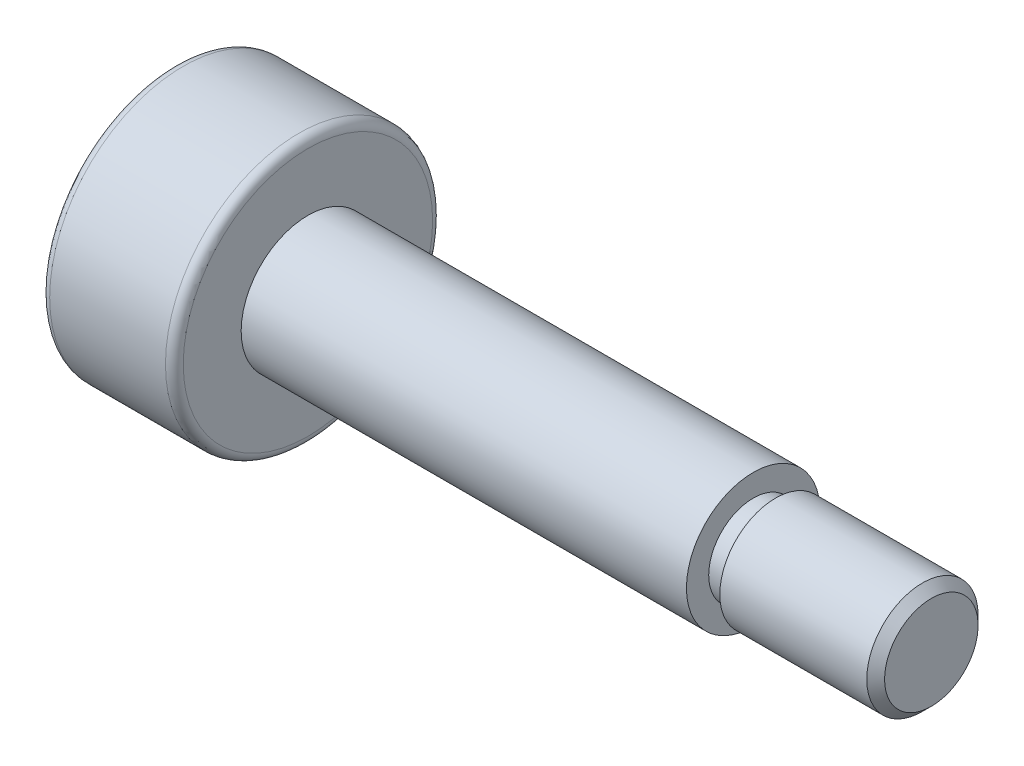
ISO-10303-21;
HEADER;
FILE_DESCRIPTION(('STEP AP214'),'2;1');
FILE_NAME('part.step','',(''),(''),'','','');
FILE_SCHEMA(('AUTOMOTIVE_DESIGN { 1 0 10303 214 1 1 1 1 }'));
ENDSEC;
DATA;
#1=APPLICATION_CONTEXT('core data for automotive mechanical design processes');
#2=APPLICATION_PROTOCOL_DEFINITION('international standard','automotive_design',2000,#1);
#3=PRODUCT_CONTEXT('',#1,'mechanical');
#4=PRODUCT('Part','Part','',(#3));
#5=PRODUCT_RELATED_PRODUCT_CATEGORY('part','',(#4));
#6=PRODUCT_DEFINITION_FORMATION('','',#4);
#7=PRODUCT_DEFINITION_CONTEXT('part definition',#1,'design');
#8=PRODUCT_DEFINITION('design','',#6,#7);
#9=PRODUCT_DEFINITION_SHAPE('','',#8);
#10=(LENGTH_UNIT() NAMED_UNIT(*) SI_UNIT(.MILLI.,.METRE.));
#11=(NAMED_UNIT(*) PLANE_ANGLE_UNIT() SI_UNIT($,.RADIAN.));
#12=(NAMED_UNIT(*) SI_UNIT($,.STERADIAN.) SOLID_ANGLE_UNIT());
#13=UNCERTAINTY_MEASURE_WITH_UNIT(LENGTH_MEASURE(1.E-05),#10,'distance_accuracy_value','');
#14=(GEOMETRIC_REPRESENTATION_CONTEXT(3) GLOBAL_UNCERTAINTY_ASSIGNED_CONTEXT((#13)) GLOBAL_UNIT_ASSIGNED_CONTEXT((#10,
#11,#12)) REPRESENTATION_CONTEXT('',''));
#15=CARTESIAN_POINT('',(0.,0.,0.));
#16=DIRECTION('',(0.,0.,1.));
#17=DIRECTION('',(1.,0.,0.));
#18=AXIS2_PLACEMENT_3D('',#15,#16,#17);
#19=CARTESIAN_POINT('',(-8.5,0.,0.));
#20=DIRECTION('',(1.,0.,0.));
#21=DIRECTION('',(0.,0.,-1.));
#22=AXIS2_PLACEMENT_3D('',#19,#20,#21);
#23=PLANE('',#22);
#24=DIRECTION('',(0.,0.866025403784438,-0.5));
#25=VECTOR('',#24,1.);
#26=CARTESIAN_POINT('',(-8.5,0.,1.73205080756888));
#27=LINE('',#26,#25);
#28=CARTESIAN_POINT('',(-8.5,0.,1.73205080756888));
#29=VERTEX_POINT('',#28);
#30=CARTESIAN_POINT('',(-8.5,1.5,0.866025403784438));
#31=VERTEX_POINT('',#30);
#32=EDGE_CURVE('E125',#29,#31,#27,.T.);
#33=ORIENTED_EDGE('',*,*,#32,.F.);
#34=DIRECTION('',(0.,0.866025403784439,0.5));
#35=VECTOR('',#34,1.);
#36=CARTESIAN_POINT('',(-8.5,-1.5,0.866025403784438));
#37=LINE('',#36,#35);
#38=CARTESIAN_POINT('',(-8.5,-1.5,0.866025403784438));
#39=VERTEX_POINT('',#38);
#40=EDGE_CURVE('E51',#39,#29,#37,.T.);
#41=ORIENTED_EDGE('',*,*,#40,.F.);
#42=DIRECTION('',(0.,0.,1.));
#43=VECTOR('',#42,1.);
#44=CARTESIAN_POINT('',(-8.5,-1.5,-0.866025403784438));
#45=LINE('',#44,#43);
#46=CARTESIAN_POINT('',(-8.5,-1.5,-0.866025403784438));
#47=VERTEX_POINT('',#46);
#48=EDGE_CURVE('E134',#47,#39,#45,.T.);
#49=ORIENTED_EDGE('',*,*,#48,.F.);
#50=DIRECTION('',(0.,-0.866025403784438,0.5));
#51=VECTOR('',#50,1.);
#52=CARTESIAN_POINT('',(-8.5,0.,-1.73205080756888));
#53=LINE('',#52,#51);
#54=CARTESIAN_POINT('',(-8.5,0.,-1.73205080756888));
#55=VERTEX_POINT('',#54);
#56=EDGE_CURVE('E132',#55,#47,#53,.T.);
#57=ORIENTED_EDGE('',*,*,#56,.F.);
#58=DIRECTION('',(0.,-0.866025403784439,-0.5));
#59=VECTOR('',#58,1.);
#60=CARTESIAN_POINT('',(-8.5,1.5,-0.866025403784438));
#61=LINE('',#60,#59);
#62=CARTESIAN_POINT('',(-8.5,1.5,-0.866025403784438));
#63=VERTEX_POINT('',#62);
#64=EDGE_CURVE('E99',#63,#55,#61,.T.);
#65=ORIENTED_EDGE('',*,*,#64,.F.);
#66=DIRECTION('',(0.,0.,-1.));
#67=VECTOR('',#66,1.);
#68=CARTESIAN_POINT('',(-8.5,1.5,0.866025403784438));
#69=LINE('',#68,#67);
#70=EDGE_CURVE('E128',#31,#63,#69,.T.);
#71=ORIENTED_EDGE('',*,*,#70,.F.);
#72=EDGE_LOOP('',(#33,#41,#49,#57,#65,#71));
#73=FACE_BOUND('',#72,.T.);
#74=CARTESIAN_POINT('',(-8.5,0.,0.));
#75=DIRECTION('',(1.,0.,0.));
#76=DIRECTION('',(0.,0.,-1.));
#77=AXIS2_PLACEMENT_3D('',#74,#75,#76);
#78=CIRCLE('',#77,2.8);
#79=CARTESIAN_POINT('',(-8.5,0.,-2.8));
#80=VERTEX_POINT('',#79);
#81=EDGE_CURVE('E167',#80,#80,#78,.F.);
#82=ORIENTED_EDGE('',*,*,#81,.T.);
#83=EDGE_LOOP('',(#82));
#84=FACE_BOUND('',#83,.T.);
#85=ADVANCED_FACE('F35',(#73,#84),#23,.F.);
#86=CARTESIAN_POINT('',(-8.5,0.,0.));
#87=DIRECTION('',(-1.,0.,0.));
#88=DIRECTION('',(0.,0.,1.));
#89=AXIS2_PLACEMENT_3D('',#86,#87,#88);
#90=CYLINDRICAL_SURFACE('',#89,3.);
#91=CARTESIAN_POINT('',(-5.7,0.,0.));
#92=DIRECTION('',(-1.,0.,0.));
#93=DIRECTION('',(0.,0.,1.));
#94=AXIS2_PLACEMENT_3D('',#91,#92,#93);
#95=CIRCLE('',#94,3.);
#96=CARTESIAN_POINT('',(-5.7,0.,3.));
#97=VERTEX_POINT('',#96);
#98=EDGE_CURVE('E161',#97,#97,#95,.T.);
#99=ORIENTED_EDGE('',*,*,#98,.T.);
#100=EDGE_LOOP('',(#99));
#101=FACE_BOUND('',#100,.T.);
#102=CARTESIAN_POINT('',(-8.3,0.,0.));
#103=DIRECTION('',(1.,0.,0.));
#104=DIRECTION('',(0.,0.,-1.));
#105=AXIS2_PLACEMENT_3D('',#102,#103,#104);
#106=CIRCLE('',#105,3.);
#107=CARTESIAN_POINT('',(-8.3,0.,-3.));
#108=VERTEX_POINT('',#107);
#109=EDGE_CURVE('E158',#108,#108,#106,.T.);
#110=ORIENTED_EDGE('',*,*,#109,.T.);
#111=EDGE_LOOP('',(#110));
#112=FACE_BOUND('',#111,.T.);
#113=ADVANCED_FACE('F189',(#101,#112),#90,.T.);
#114=CARTESIAN_POINT('',(-5.5,3.,0.));
#115=DIRECTION('',(-1.,0.,0.));
#116=DIRECTION('',(0.,0.,1.));
#117=AXIS2_PLACEMENT_3D('',#114,#115,#116);
#118=PLANE('',#117);
#119=CARTESIAN_POINT('',(-5.5,0.,0.));
#120=DIRECTION('',(-1.,0.,0.));
#121=DIRECTION('',(0.,0.,1.));
#122=AXIS2_PLACEMENT_3D('',#119,#120,#121);
#123=CIRCLE('',#122,2.8);
#124=CARTESIAN_POINT('',(-5.5,0.,2.8));
#125=VERTEX_POINT('',#124);
#126=EDGE_CURVE('E164',#125,#125,#123,.F.);
#127=ORIENTED_EDGE('',*,*,#126,.T.);
#128=EDGE_LOOP('',(#127));
#129=FACE_BOUND('',#128,.T.);
#130=CARTESIAN_POINT('',(-5.5,0.,0.));
#131=DIRECTION('',(-1.,0.,0.));
#132=DIRECTION('',(0.,0.,1.));
#133=AXIS2_PLACEMENT_3D('',#130,#131,#132);
#134=CIRCLE('',#133,1.5);
#135=CARTESIAN_POINT('',(-5.5,0.,1.5));
#136=VERTEX_POINT('',#135);
#137=EDGE_CURVE('E155',#136,#136,#134,.T.);
#138=ORIENTED_EDGE('',*,*,#137,.T.);
#139=EDGE_LOOP('',(#138));
#140=FACE_BOUND('',#139,.T.);
#141=ADVANCED_FACE('F195',(#129,#140),#118,.F.);
#142=CARTESIAN_POINT('',(-8.5,0.,0.));
#143=DIRECTION('',(-1.,0.,0.));
#144=DIRECTION('',(0.,0.,1.));
#145=AXIS2_PLACEMENT_3D('',#142,#143,#144);
#146=CYLINDRICAL_SURFACE('',#145,1.5);
#147=ORIENTED_EDGE('',*,*,#137,.F.);
#148=EDGE_LOOP('',(#147));
#149=FACE_BOUND('',#148,.T.);
#150=CARTESIAN_POINT('',(4.5,0.,0.));
#151=DIRECTION('',(-1.,0.,0.));
#152=DIRECTION('',(0.,0.,1.));
#153=AXIS2_PLACEMENT_3D('',#150,#151,#152);
#154=CIRCLE('',#153,1.5);
#155=CARTESIAN_POINT('',(4.5,0.,1.5));
#156=VERTEX_POINT('',#155);
#157=EDGE_CURVE('E152',#156,#156,#154,.T.);
#158=ORIENTED_EDGE('',*,*,#157,.T.);
#159=EDGE_LOOP('',(#158));
#160=FACE_BOUND('',#159,.T.);
#161=ADVANCED_FACE('F229',(#149,#160),#146,.T.);
#162=CARTESIAN_POINT('',(4.5,1.5,0.));
#163=DIRECTION('',(-1.,0.,0.));
#164=DIRECTION('',(0.,0.,1.));
#165=AXIS2_PLACEMENT_3D('',#162,#163,#164);
#166=PLANE('',#165);
#167=ORIENTED_EDGE('',*,*,#157,.F.);
#168=EDGE_LOOP('',(#167));
#169=FACE_BOUND('',#168,.T.);
#170=CARTESIAN_POINT('',(4.5,0.,0.));
#171=DIRECTION('',(-1.,0.,0.));
#172=DIRECTION('',(0.,0.,1.));
#173=AXIS2_PLACEMENT_3D('',#170,#171,#172);
#174=CIRCLE('',#173,1.);
#175=CARTESIAN_POINT('',(4.5,0.,1.));
#176=VERTEX_POINT('',#175);
#177=EDGE_CURVE('E149',#176,#176,#174,.T.);
#178=ORIENTED_EDGE('',*,*,#177,.T.);
#179=EDGE_LOOP('',(#178));
#180=FACE_BOUND('',#179,.T.);
#181=ADVANCED_FACE('F205',(#169,#180),#166,.F.);
#182=CARTESIAN_POINT('',(-5.7,0.,0.));
#183=DIRECTION('',(-1.,0.,0.));
#184=DIRECTION('',(0.,0.,1.));
#185=AXIS2_PLACEMENT_3D('',#182,#183,#184);
#186=TOROIDAL_SURFACE('',#185,2.8,0.2);
#187=ORIENTED_EDGE('',*,*,#126,.F.);
#188=EDGE_LOOP('',(#187));
#189=FACE_BOUND('',#188,.T.);
#190=ORIENTED_EDGE('',*,*,#98,.F.);
#191=EDGE_LOOP('',(#190));
#192=FACE_BOUND('',#191,.T.);
#193=ADVANCED_FACE('F202',(#189,#192),#186,.T.);
#194=CARTESIAN_POINT('',(-8.3,0.,0.));
#195=DIRECTION('',(1.,0.,0.));
#196=DIRECTION('',(0.,0.,-1.));
#197=AXIS2_PLACEMENT_3D('',#194,#195,#196);
#198=TOROIDAL_SURFACE('',#197,2.8,0.2);
#199=ORIENTED_EDGE('',*,*,#109,.F.);
#200=EDGE_LOOP('',(#199));
#201=FACE_BOUND('',#200,.T.);
#202=ORIENTED_EDGE('',*,*,#81,.F.);
#203=EDGE_LOOP('',(#202));
#204=FACE_BOUND('',#203,.T.);
#205=ADVANCED_FACE('F204',(#201,#204),#198,.T.);
#206=CARTESIAN_POINT('',(4.5,0.,0.));
#207=DIRECTION('',(-1.,0.,0.));
#208=DIRECTION('',(0.,0.,1.));
#209=AXIS2_PLACEMENT_3D('',#206,#207,#208);
#210=CYLINDRICAL_SURFACE('',#209,1.);
#211=CARTESIAN_POINT('',(5.,0.,0.));
#212=DIRECTION('',(-1.,0.,0.));
#213=DIRECTION('',(0.,0.,1.));
#214=AXIS2_PLACEMENT_3D('',#211,#212,#213);
#215=CIRCLE('',#214,1.);
#216=CARTESIAN_POINT('',(5.,0.,1.));
#217=VERTEX_POINT('',#216);
#218=EDGE_CURVE('E146',#217,#217,#215,.T.);
#219=ORIENTED_EDGE('',*,*,#218,.T.);
#220=EDGE_LOOP('',(#219));
#221=FACE_BOUND('',#220,.T.);
#222=ORIENTED_EDGE('',*,*,#177,.F.);
#223=EDGE_LOOP('',(#222));
#224=FACE_BOUND('',#223,.T.);
#225=ADVANCED_FACE('F208',(#221,#224),#210,.T.);
#226=CARTESIAN_POINT('',(5.,1.25,0.));
#227=DIRECTION('',(-1.,0.,0.));
#228=DIRECTION('',(0.,0.,1.));
#229=AXIS2_PLACEMENT_3D('',#226,#227,#228);
#230=PLANE('',#229);
#231=CARTESIAN_POINT('',(5.,0.,0.));
#232=DIRECTION('',(-1.,0.,0.));
#233=DIRECTION('',(0.,0.,1.));
#234=AXIS2_PLACEMENT_3D('',#231,#232,#233);
#235=CIRCLE('',#234,1.25);
#236=CARTESIAN_POINT('',(5.,0.,1.25));
#237=VERTEX_POINT('',#236);
#238=EDGE_CURVE('E138',#237,#237,#235,.T.);
#239=ORIENTED_EDGE('',*,*,#238,.T.);
#240=EDGE_LOOP('',(#239));
#241=FACE_BOUND('',#240,.T.);
#242=ORIENTED_EDGE('',*,*,#218,.F.);
#243=EDGE_LOOP('',(#242));
#244=FACE_BOUND('',#243,.T.);
#245=ADVANCED_FACE('F184',(#241,#244),#230,.T.);
#246=CARTESIAN_POINT('',(8.5,1.25,0.));
#247=DIRECTION('',(-1.,0.,0.));
#248=DIRECTION('',(0.,0.,1.));
#249=AXIS2_PLACEMENT_3D('',#246,#247,#248);
#250=PLANE('',#249);
#251=CARTESIAN_POINT('',(8.5,0.,0.));
#252=DIRECTION('',(-1.,0.,0.));
#253=DIRECTION('',(0.,0.,1.));
#254=AXIS2_PLACEMENT_3D('',#251,#252,#253);
#255=CIRCLE('',#254,1.05);
#256=CARTESIAN_POINT('',(8.5,0.,1.05));
#257=VERTEX_POINT('',#256);
#258=EDGE_CURVE('E11',#257,#257,#255,.F.);
#259=ORIENTED_EDGE('',*,*,#258,.T.);
#260=EDGE_LOOP('',(#259));
#261=FACE_BOUND('',#260,.T.);
#262=ADVANCED_FACE('F176',(#261),#250,.F.);
#263=CARTESIAN_POINT('',(8.3,0.,0.));
#264=DIRECTION('',(-1.,0.,0.));
#265=DIRECTION('',(0.,0.,1.));
#266=AXIS2_PLACEMENT_3D('',#263,#264,#265);
#267=CONICAL_SURFACE('',#266,1.25,0.78539816339745);
#268=ORIENTED_EDGE('',*,*,#258,.F.);
#269=EDGE_LOOP('',(#268));
#270=FACE_BOUND('',#269,.T.);
#271=CARTESIAN_POINT('',(8.3,0.,0.));
#272=DIRECTION('',(-1.,0.,0.));
#273=DIRECTION('',(0.,0.,1.));
#274=AXIS2_PLACEMENT_3D('',#271,#272,#273);
#275=CIRCLE('',#274,1.25);
#276=CARTESIAN_POINT('',(8.3,0.,1.25));
#277=VERTEX_POINT('',#276);
#278=EDGE_CURVE('E44',#277,#277,#275,.T.);
#279=ORIENTED_EDGE('',*,*,#278,.F.);
#280=EDGE_LOOP('',(#279));
#281=FACE_BOUND('',#280,.T.);
#282=ADVANCED_FACE('F38',(#270,#281),#267,.T.);
#283=CARTESIAN_POINT('',(-8.5,0.,0.));
#284=DIRECTION('',(-1.,0.,0.));
#285=DIRECTION('',(0.,0.,1.));
#286=AXIS2_PLACEMENT_3D('',#283,#284,#285);
#287=CYLINDRICAL_SURFACE('',#286,1.25);
#288=ORIENTED_EDGE('',*,*,#278,.T.);
#289=EDGE_LOOP('',(#288));
#290=FACE_BOUND('',#289,.T.);
#291=ORIENTED_EDGE('',*,*,#238,.F.);
#292=EDGE_LOOP('',(#291));
#293=FACE_BOUND('',#292,.T.);
#294=ADVANCED_FACE('F172',(#290,#293),#287,.T.);
#295=CARTESIAN_POINT('',(-6.5,-1.5,0.866025403784438));
#296=DIRECTION('',(0.,-0.5,0.866025403784439));
#297=DIRECTION('',(0.,-0.866025403784439,-0.5));
#298=AXIS2_PLACEMENT_3D('',#295,#296,#297);
#299=PLANE('',#298);
#300=ORIENTED_EDGE('',*,*,#40,.T.);
#301=DIRECTION('',(-1.,0.,0.));
#302=VECTOR('',#301,1.);
#303=CARTESIAN_POINT('',(-6.5,0.,1.73205080756888));
#304=LINE('',#303,#302);
#305=CARTESIAN_POINT('',(-6.5,0.,1.73205080756888));
#306=VERTEX_POINT('',#305);
#307=EDGE_CURVE('E81',#306,#29,#304,.T.);
#308=ORIENTED_EDGE('',*,*,#307,.F.);
#309=DIRECTION('',(0.,0.866025403784439,0.5));
#310=VECTOR('',#309,1.);
#311=CARTESIAN_POINT('',(-6.5,-1.5,0.866025403784438));
#312=LINE('',#311,#310);
#313=CARTESIAN_POINT('',(-6.5,-1.5,0.866025403784438));
#314=VERTEX_POINT('',#313);
#315=EDGE_CURVE('E136',#314,#306,#312,.T.);
#316=ORIENTED_EDGE('',*,*,#315,.F.);
#317=DIRECTION('',(-1.,0.,0.));
#318=VECTOR('',#317,1.);
#319=CARTESIAN_POINT('',(-6.5,-1.5,0.866025403784438));
#320=LINE('',#319,#318);
#321=EDGE_CURVE('E59',#314,#39,#320,.T.);
#322=ORIENTED_EDGE('',*,*,#321,.T.);
#323=EDGE_LOOP('',(#300,#308,#316,#322));
#324=FACE_BOUND('',#323,.T.);
#325=ADVANCED_FACE('F182',(#324),#299,.F.);
#326=CARTESIAN_POINT('',(-6.5,-1.5,-0.866025403784438));
#327=DIRECTION('',(0.,-1.,0.));
#328=DIRECTION('',(0.,0.,-1.));
#329=AXIS2_PLACEMENT_3D('',#326,#327,#328);
#330=PLANE('',#329);
#331=ORIENTED_EDGE('',*,*,#48,.T.);
#332=ORIENTED_EDGE('',*,*,#321,.F.);
#333=DIRECTION('',(0.,0.,1.));
#334=VECTOR('',#333,1.);
#335=CARTESIAN_POINT('',(-6.5,-1.5,-0.866025403784438));
#336=LINE('',#335,#334);
#337=CARTESIAN_POINT('',(-6.5,-1.5,-0.866025403784438));
#338=VERTEX_POINT('',#337);
#339=EDGE_CURVE('E111',#338,#314,#336,.T.);
#340=ORIENTED_EDGE('',*,*,#339,.F.);
#341=DIRECTION('',(-1.,0.,0.));
#342=VECTOR('',#341,1.);
#343=CARTESIAN_POINT('',(-6.5,-1.5,-0.866025403784438));
#344=LINE('',#343,#342);
#345=EDGE_CURVE('E103',#338,#47,#344,.T.);
#346=ORIENTED_EDGE('',*,*,#345,.T.);
#347=EDGE_LOOP('',(#331,#332,#340,#346));
#348=FACE_BOUND('',#347,.T.);
#349=ADVANCED_FACE('F303',(#348),#330,.F.);
#350=CARTESIAN_POINT('',(-6.5,0.,-1.73205080756888));
#351=DIRECTION('',(0.,-0.5,-0.866025403784438));
#352=DIRECTION('',(0.,0.866025403784439,-0.5));
#353=AXIS2_PLACEMENT_3D('',#350,#351,#352);
#354=PLANE('',#353);
#355=ORIENTED_EDGE('',*,*,#56,.T.);
#356=ORIENTED_EDGE('',*,*,#345,.F.);
#357=DIRECTION('',(0.,-0.866025403784438,0.5));
#358=VECTOR('',#357,1.);
#359=CARTESIAN_POINT('',(-6.5,0.,-1.73205080756888));
#360=LINE('',#359,#358);
#361=CARTESIAN_POINT('',(-6.5,0.,-1.73205080756888));
#362=VERTEX_POINT('',#361);
#363=EDGE_CURVE('E107',#362,#338,#360,.T.);
#364=ORIENTED_EDGE('',*,*,#363,.F.);
#365=DIRECTION('',(-1.,0.,0.));
#366=VECTOR('',#365,1.);
#367=CARTESIAN_POINT('',(-6.5,0.,-1.73205080756888));
#368=LINE('',#367,#366);
#369=EDGE_CURVE('E92',#362,#55,#368,.T.);
#370=ORIENTED_EDGE('',*,*,#369,.T.);
#371=EDGE_LOOP('',(#355,#356,#364,#370));
#372=FACE_BOUND('',#371,.T.);
#373=ADVANCED_FACE('F108',(#372),#354,.F.);
#374=CARTESIAN_POINT('',(-6.5,1.5,-0.866025403784438));
#375=DIRECTION('',(0.,0.5,-0.866025403784439));
#376=DIRECTION('',(0.,0.866025403784439,0.5));
#377=AXIS2_PLACEMENT_3D('',#374,#375,#376);
#378=PLANE('',#377);
#379=ORIENTED_EDGE('',*,*,#64,.T.);
#380=ORIENTED_EDGE('',*,*,#369,.F.);
#381=DIRECTION('',(0.,-0.866025403784439,-0.5));
#382=VECTOR('',#381,1.);
#383=CARTESIAN_POINT('',(-6.5,1.5,-0.866025403784438));
#384=LINE('',#383,#382);
#385=CARTESIAN_POINT('',(-6.5,1.5,-0.866025403784438));
#386=VERTEX_POINT('',#385);
#387=EDGE_CURVE('E96',#386,#362,#384,.T.);
#388=ORIENTED_EDGE('',*,*,#387,.F.);
#389=DIRECTION('',(-1.,0.,0.));
#390=VECTOR('',#389,1.);
#391=CARTESIAN_POINT('',(-6.5,1.5,-0.866025403784438));
#392=LINE('',#391,#390);
#393=EDGE_CURVE('E104',#386,#63,#392,.T.);
#394=ORIENTED_EDGE('',*,*,#393,.T.);
#395=EDGE_LOOP('',(#379,#380,#388,#394));
#396=FACE_BOUND('',#395,.T.);
#397=ADVANCED_FACE('F94',(#396),#378,.F.);
#398=CARTESIAN_POINT('',(-6.5,1.5,0.866025403784438));
#399=DIRECTION('',(0.,1.,0.));
#400=DIRECTION('',(0.,0.,1.));
#401=AXIS2_PLACEMENT_3D('',#398,#399,#400);
#402=PLANE('',#401);
#403=ORIENTED_EDGE('',*,*,#70,.T.);
#404=ORIENTED_EDGE('',*,*,#393,.F.);
#405=DIRECTION('',(0.,0.,-1.));
#406=VECTOR('',#405,1.);
#407=CARTESIAN_POINT('',(-6.5,1.5,0.866025403784438));
#408=LINE('',#407,#406);
#409=CARTESIAN_POINT('',(-6.5,1.5,0.866025403784438));
#410=VERTEX_POINT('',#409);
#411=EDGE_CURVE('E117',#410,#386,#408,.T.);
#412=ORIENTED_EDGE('',*,*,#411,.F.);
#413=DIRECTION('',(-1.,0.,0.));
#414=VECTOR('',#413,1.);
#415=CARTESIAN_POINT('',(-6.5,1.5,0.866025403784438));
#416=LINE('',#415,#414);
#417=EDGE_CURVE('E141',#410,#31,#416,.T.);
#418=ORIENTED_EDGE('',*,*,#417,.T.);
#419=EDGE_LOOP('',(#403,#404,#412,#418));
#420=FACE_BOUND('',#419,.T.);
#421=ADVANCED_FACE('F324',(#420),#402,.F.);
#422=CARTESIAN_POINT('',(-6.5,0.,1.73205080756888));
#423=DIRECTION('',(0.,0.5,0.866025403784438));
#424=DIRECTION('',(0.,-0.866025403784439,0.5));
#425=AXIS2_PLACEMENT_3D('',#422,#423,#424);
#426=PLANE('',#425);
#427=ORIENTED_EDGE('',*,*,#32,.T.);
#428=ORIENTED_EDGE('',*,*,#417,.F.);
#429=DIRECTION('',(0.,0.866025403784438,-0.5));
#430=VECTOR('',#429,1.);
#431=CARTESIAN_POINT('',(-6.5,0.,1.73205080756888));
#432=LINE('',#431,#430);
#433=EDGE_CURVE('E119',#306,#410,#432,.T.);
#434=ORIENTED_EDGE('',*,*,#433,.F.);
#435=ORIENTED_EDGE('',*,*,#307,.T.);
#436=EDGE_LOOP('',(#427,#428,#434,#435));
#437=FACE_BOUND('',#436,.T.);
#438=ADVANCED_FACE('F332',(#437),#426,.F.);
#439=CARTESIAN_POINT('',(-6.5,0.,0.));
#440=DIRECTION('',(-1.,0.,0.));
#441=DIRECTION('',(0.,0.,1.));
#442=AXIS2_PLACEMENT_3D('',#439,#440,#441);
#443=PLANE('',#442);
#444=ORIENTED_EDGE('',*,*,#315,.T.);
#445=ORIENTED_EDGE('',*,*,#433,.T.);
#446=ORIENTED_EDGE('',*,*,#411,.T.);
#447=ORIENTED_EDGE('',*,*,#387,.T.);
#448=ORIENTED_EDGE('',*,*,#363,.T.);
#449=ORIENTED_EDGE('',*,*,#339,.T.);
#450=EDGE_LOOP('',(#444,#445,#446,#447,#448,#449));
#451=FACE_BOUND('',#450,.T.);
#452=ADVANCED_FACE('F114',(#451),#443,.T.);
#453=CLOSED_SHELL('',(#85,#113,#141,#161,#181,#193,#205,#225,#245,#262,#282,#294,#325,#349,#373,
#397,#421,#438,#452));
#454=MANIFOLD_SOLID_BREP('B2',#453);
#455=ADVANCED_BREP_SHAPE_REPRESENTATION('',(#18,#454),#14);
#456=SHAPE_DEFINITION_REPRESENTATION(#9,#455);
ENDSEC;
END-ISO-10303-21;
